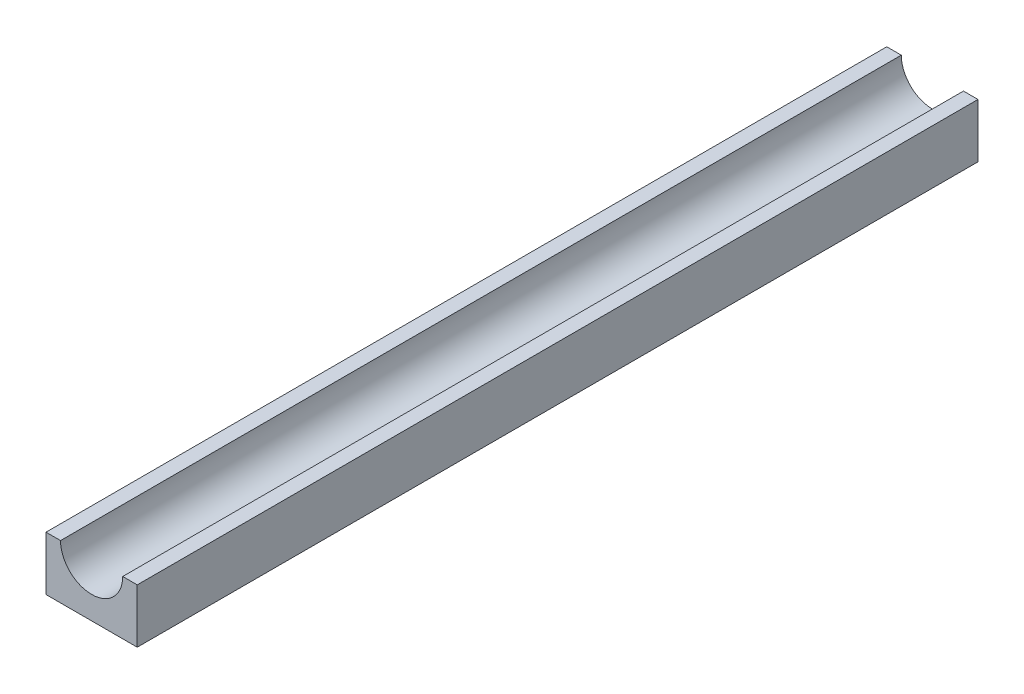
ISO-10303-21;
HEADER;
FILE_DESCRIPTION(('STEP AP214'),'2;1');
FILE_NAME('part.step','',(''),(''),'','','');
FILE_SCHEMA(('AUTOMOTIVE_DESIGN { 1 0 10303 214 1 1 1 1 }'));
ENDSEC;
DATA;
#1=APPLICATION_CONTEXT('core data for automotive mechanical design processes');
#2=APPLICATION_PROTOCOL_DEFINITION('international standard','automotive_design',2000,#1);
#3=PRODUCT_CONTEXT('',#1,'mechanical');
#4=PRODUCT('Part','Part','',(#3));
#5=PRODUCT_RELATED_PRODUCT_CATEGORY('part','',(#4));
#6=PRODUCT_DEFINITION_FORMATION('','',#4);
#7=PRODUCT_DEFINITION_CONTEXT('part definition',#1,'design');
#8=PRODUCT_DEFINITION('design','',#6,#7);
#9=PRODUCT_DEFINITION_SHAPE('','',#8);
#10=(LENGTH_UNIT() NAMED_UNIT(*) SI_UNIT(.MILLI.,.METRE.));
#11=(NAMED_UNIT(*) PLANE_ANGLE_UNIT() SI_UNIT($,.RADIAN.));
#12=(NAMED_UNIT(*) SI_UNIT($,.STERADIAN.) SOLID_ANGLE_UNIT());
#13=UNCERTAINTY_MEASURE_WITH_UNIT(LENGTH_MEASURE(1.E-05),#10,'distance_accuracy_value','');
#14=(GEOMETRIC_REPRESENTATION_CONTEXT(3) GLOBAL_UNCERTAINTY_ASSIGNED_CONTEXT((#13)) GLOBAL_UNIT_ASSIGNED_CONTEXT((#10,
#11,#12)) REPRESENTATION_CONTEXT('',''));
#15=CARTESIAN_POINT('',(0.,0.,0.));
#16=DIRECTION('',(0.,0.,1.));
#17=DIRECTION('',(1.,0.,0.));
#18=AXIS2_PLACEMENT_3D('',#15,#16,#17);
#19=CARTESIAN_POINT('',(-11.9375,7.06875,220.));
#20=DIRECTION('',(0.,1.,0.));
#21=DIRECTION('',(0.,0.,1.));
#22=AXIS2_PLACEMENT_3D('',#19,#20,#21);
#23=PLANE('',#22);
#24=DIRECTION('',(1.,0.,0.));
#25=VECTOR('',#24,1.);
#26=CARTESIAN_POINT('',(-11.9375,7.06875,0.));
#27=LINE('',#26,#25);
#28=CARTESIAN_POINT('',(-11.9375,7.06875,0.));
#29=VERTEX_POINT('',#28);
#30=CARTESIAN_POINT('',(-8.1375,7.06875,0.));
#31=VERTEX_POINT('',#30);
#32=EDGE_CURVE('E120',#29,#31,#27,.T.);
#33=ORIENTED_EDGE('',*,*,#32,.F.);
#34=DIRECTION('',(0.,0.,-1.));
#35=VECTOR('',#34,1.);
#36=CARTESIAN_POINT('',(-11.9375,7.06875,220.));
#37=LINE('',#36,#35);
#38=CARTESIAN_POINT('',(-11.9375,7.06875,220.));
#39=VERTEX_POINT('',#38);
#40=EDGE_CURVE('E11',#39,#29,#37,.T.);
#41=ORIENTED_EDGE('',*,*,#40,.F.);
#42=DIRECTION('',(1.,0.,0.));
#43=VECTOR('',#42,1.);
#44=CARTESIAN_POINT('',(-11.9375,7.06875,220.));
#45=LINE('',#44,#43);
#46=CARTESIAN_POINT('',(-8.1375,7.06875,220.));
#47=VERTEX_POINT('',#46);
#48=EDGE_CURVE('E134',#39,#47,#45,.T.);
#49=ORIENTED_EDGE('',*,*,#48,.T.);
#50=DIRECTION('',(0.,0.,-1.));
#51=VECTOR('',#50,1.);
#52=CARTESIAN_POINT('',(-8.1375,7.06875,220.));
#53=LINE('',#52,#51);
#54=EDGE_CURVE('E38',#47,#31,#53,.T.);
#55=ORIENTED_EDGE('',*,*,#54,.T.);
#56=EDGE_LOOP('',(#33,#41,#49,#55));
#57=FACE_BOUND('',#56,.T.);
#58=ADVANCED_FACE('F35',(#57),#23,.T.);
#59=CARTESIAN_POINT('',(-11.9375,-7.06875,220.));
#60=DIRECTION('',(-1.,0.,0.));
#61=DIRECTION('',(0.,0.,1.));
#62=AXIS2_PLACEMENT_3D('',#59,#60,#61);
#63=PLANE('',#62);
#64=DIRECTION('',(0.,1.,0.));
#65=VECTOR('',#64,1.);
#66=CARTESIAN_POINT('',(-11.9375,-7.06875,0.));
#67=LINE('',#66,#65);
#68=CARTESIAN_POINT('',(-11.9375,-7.06875,0.));
#69=VERTEX_POINT('',#68);
#70=EDGE_CURVE('E132',#69,#29,#67,.T.);
#71=ORIENTED_EDGE('',*,*,#70,.F.);
#72=DIRECTION('',(0.,0.,-1.));
#73=VECTOR('',#72,1.);
#74=CARTESIAN_POINT('',(-11.9375,-7.06875,220.));
#75=LINE('',#74,#73);
#76=CARTESIAN_POINT('',(-11.9375,-7.06875,220.));
#77=VERTEX_POINT('',#76);
#78=EDGE_CURVE('E44',#77,#69,#75,.T.);
#79=ORIENTED_EDGE('',*,*,#78,.F.);
#80=DIRECTION('',(0.,1.,0.));
#81=VECTOR('',#80,1.);
#82=CARTESIAN_POINT('',(-11.9375,-7.06875,220.));
#83=LINE('',#82,#81);
#84=EDGE_CURVE('E100',#77,#39,#83,.T.);
#85=ORIENTED_EDGE('',*,*,#84,.T.);
#86=ORIENTED_EDGE('',*,*,#40,.T.);
#87=EDGE_LOOP('',(#71,#79,#85,#86));
#88=FACE_BOUND('',#87,.T.);
#89=ADVANCED_FACE('F142',(#88),#63,.T.);
#90=CARTESIAN_POINT('',(-11.9375,-7.06875,220.));
#91=DIRECTION('',(0.,1.,0.));
#92=DIRECTION('',(0.,0.,1.));
#93=AXIS2_PLACEMENT_3D('',#90,#91,#92);
#94=PLANE('',#93);
#95=DIRECTION('',(1.,0.,0.));
#96=VECTOR('',#95,1.);
#97=CARTESIAN_POINT('',(-11.9375,-7.06875,0.));
#98=LINE('',#97,#96);
#99=CARTESIAN_POINT('',(11.9375,-7.06875,0.));
#100=VERTEX_POINT('',#99);
#101=EDGE_CURVE('E105',#69,#100,#98,.T.);
#102=ORIENTED_EDGE('',*,*,#101,.T.);
#103=DIRECTION('',(0.,0.,-1.));
#104=VECTOR('',#103,1.);
#105=CARTESIAN_POINT('',(11.9375,-7.06875,220.));
#106=LINE('',#105,#104);
#107=CARTESIAN_POINT('',(11.9375,-7.06875,220.));
#108=VERTEX_POINT('',#107);
#109=EDGE_CURVE('E103',#108,#100,#106,.T.);
#110=ORIENTED_EDGE('',*,*,#109,.F.);
#111=DIRECTION('',(1.,0.,0.));
#112=VECTOR('',#111,1.);
#113=CARTESIAN_POINT('',(-11.9375,-7.06875,220.));
#114=LINE('',#113,#112);
#115=EDGE_CURVE('E93',#77,#108,#114,.T.);
#116=ORIENTED_EDGE('',*,*,#115,.F.);
#117=ORIENTED_EDGE('',*,*,#78,.T.);
#118=EDGE_LOOP('',(#102,#110,#116,#117));
#119=FACE_BOUND('',#118,.T.);
#120=ADVANCED_FACE('F104',(#119),#94,.F.);
#121=CARTESIAN_POINT('',(11.9375,-7.06875,220.));
#122=DIRECTION('',(-1.,0.,0.));
#123=DIRECTION('',(0.,0.,1.));
#124=AXIS2_PLACEMENT_3D('',#121,#122,#123);
#125=PLANE('',#124);
#126=DIRECTION('',(0.,1.,0.));
#127=VECTOR('',#126,1.);
#128=CARTESIAN_POINT('',(11.9375,-7.06875,0.));
#129=LINE('',#128,#127);
#130=CARTESIAN_POINT('',(11.9375,7.06875,0.));
#131=VERTEX_POINT('',#130);
#132=EDGE_CURVE('E129',#100,#131,#129,.T.);
#133=ORIENTED_EDGE('',*,*,#132,.T.);
#134=DIRECTION('',(0.,0.,-1.));
#135=VECTOR('',#134,1.);
#136=CARTESIAN_POINT('',(11.9375,7.06875,220.));
#137=LINE('',#136,#135);
#138=CARTESIAN_POINT('',(11.9375,7.06875,220.));
#139=VERTEX_POINT('',#138);
#140=EDGE_CURVE('E109',#139,#131,#137,.T.);
#141=ORIENTED_EDGE('',*,*,#140,.F.);
#142=DIRECTION('',(0.,1.,0.));
#143=VECTOR('',#142,1.);
#144=CARTESIAN_POINT('',(11.9375,-7.06875,220.));
#145=LINE('',#144,#143);
#146=EDGE_CURVE('E98',#108,#139,#145,.T.);
#147=ORIENTED_EDGE('',*,*,#146,.F.);
#148=ORIENTED_EDGE('',*,*,#109,.T.);
#149=EDGE_LOOP('',(#133,#141,#147,#148));
#150=FACE_BOUND('',#149,.T.);
#151=ADVANCED_FACE('F111',(#150),#125,.F.);
#152=CARTESIAN_POINT('',(8.1375,7.06875,220.));
#153=DIRECTION('',(0.,1.,0.));
#154=DIRECTION('',(0.,0.,1.));
#155=AXIS2_PLACEMENT_3D('',#152,#153,#154);
#156=PLANE('',#155);
#157=DIRECTION('',(1.,0.,0.));
#158=VECTOR('',#157,1.);
#159=CARTESIAN_POINT('',(8.1375,7.06875,0.));
#160=LINE('',#159,#158);
#161=CARTESIAN_POINT('',(8.1375,7.06875,0.));
#162=VERTEX_POINT('',#161);
#163=EDGE_CURVE('E126',#162,#131,#160,.T.);
#164=ORIENTED_EDGE('',*,*,#163,.F.);
#165=DIRECTION('',(0.,0.,-1.));
#166=VECTOR('',#165,1.);
#167=CARTESIAN_POINT('',(8.1375,7.06875,220.));
#168=LINE('',#167,#166);
#169=CARTESIAN_POINT('',(8.1375,7.06875,220.));
#170=VERTEX_POINT('',#169);
#171=EDGE_CURVE('E137',#170,#162,#168,.T.);
#172=ORIENTED_EDGE('',*,*,#171,.F.);
#173=DIRECTION('',(1.,0.,0.));
#174=VECTOR('',#173,1.);
#175=CARTESIAN_POINT('',(8.1375,7.06875,220.));
#176=LINE('',#175,#174);
#177=EDGE_CURVE('E113',#170,#139,#176,.T.);
#178=ORIENTED_EDGE('',*,*,#177,.T.);
#179=ORIENTED_EDGE('',*,*,#140,.T.);
#180=EDGE_LOOP('',(#164,#172,#178,#179));
#181=FACE_BOUND('',#180,.T.);
#182=ADVANCED_FACE('F155',(#181),#156,.T.);
#183=CARTESIAN_POINT('',(0.,7.06875,220.));
#184=DIRECTION('',(0.,0.,-1.));
#185=DIRECTION('',(-1.,0.,0.));
#186=AXIS2_PLACEMENT_3D('',#183,#184,#185);
#187=CYLINDRICAL_SURFACE('',#186,8.1375);
#188=CARTESIAN_POINT('',(0.,7.06875,0.));
#189=DIRECTION('',(0.,0.,1.));
#190=DIRECTION('',(1.,0.,0.));
#191=AXIS2_PLACEMENT_3D('',#188,#189,#190);
#192=CIRCLE('',#191,8.1375);
#193=EDGE_CURVE('E123',#31,#162,#192,.T.);
#194=ORIENTED_EDGE('',*,*,#193,.F.);
#195=ORIENTED_EDGE('',*,*,#54,.F.);
#196=CARTESIAN_POINT('',(0.,7.06875,220.));
#197=DIRECTION('',(0.,0.,1.));
#198=DIRECTION('',(1.,0.,0.));
#199=AXIS2_PLACEMENT_3D('',#196,#197,#198);
#200=CIRCLE('',#199,8.1375);
#201=EDGE_CURVE('E115',#47,#170,#200,.T.);
#202=ORIENTED_EDGE('',*,*,#201,.T.);
#203=ORIENTED_EDGE('',*,*,#171,.T.);
#204=EDGE_LOOP('',(#194,#195,#202,#203));
#205=FACE_BOUND('',#204,.T.);
#206=ADVANCED_FACE('F139',(#205),#187,.F.);
#207=CARTESIAN_POINT('',(0.,7.06875,220.));
#208=DIRECTION('',(0.,0.,1.));
#209=DIRECTION('',(1.,0.,0.));
#210=AXIS2_PLACEMENT_3D('',#207,#208,#209);
#211=PLANE('',#210);
#212=ORIENTED_EDGE('',*,*,#48,.F.);
#213=ORIENTED_EDGE('',*,*,#84,.F.);
#214=ORIENTED_EDGE('',*,*,#115,.T.);
#215=ORIENTED_EDGE('',*,*,#146,.T.);
#216=ORIENTED_EDGE('',*,*,#177,.F.);
#217=ORIENTED_EDGE('',*,*,#201,.F.);
#218=EDGE_LOOP('',(#212,#213,#214,#215,#216,#217));
#219=FACE_BOUND('',#218,.T.);
#220=ADVANCED_FACE('F95',(#219),#211,.T.);
#221=CARTESIAN_POINT('',(0.,7.06875,0.));
#222=DIRECTION('',(0.,0.,1.));
#223=DIRECTION('',(1.,0.,0.));
#224=AXIS2_PLACEMENT_3D('',#221,#222,#223);
#225=PLANE('',#224);
#226=ORIENTED_EDGE('',*,*,#32,.T.);
#227=ORIENTED_EDGE('',*,*,#193,.T.);
#228=ORIENTED_EDGE('',*,*,#163,.T.);
#229=ORIENTED_EDGE('',*,*,#132,.F.);
#230=ORIENTED_EDGE('',*,*,#101,.F.);
#231=ORIENTED_EDGE('',*,*,#70,.T.);
#232=EDGE_LOOP('',(#226,#227,#228,#229,#230,#231));
#233=FACE_BOUND('',#232,.T.);
#234=ADVANCED_FACE('F141',(#233),#225,.F.);
#235=CLOSED_SHELL('',(#58,#89,#120,#151,#182,#206,#220,#234));
#236=MANIFOLD_SOLID_BREP('B2',#235);
#237=ADVANCED_BREP_SHAPE_REPRESENTATION('',(#18,#236),#14);
#238=SHAPE_DEFINITION_REPRESENTATION(#9,#237);
ENDSEC;
END-ISO-10303-21;
